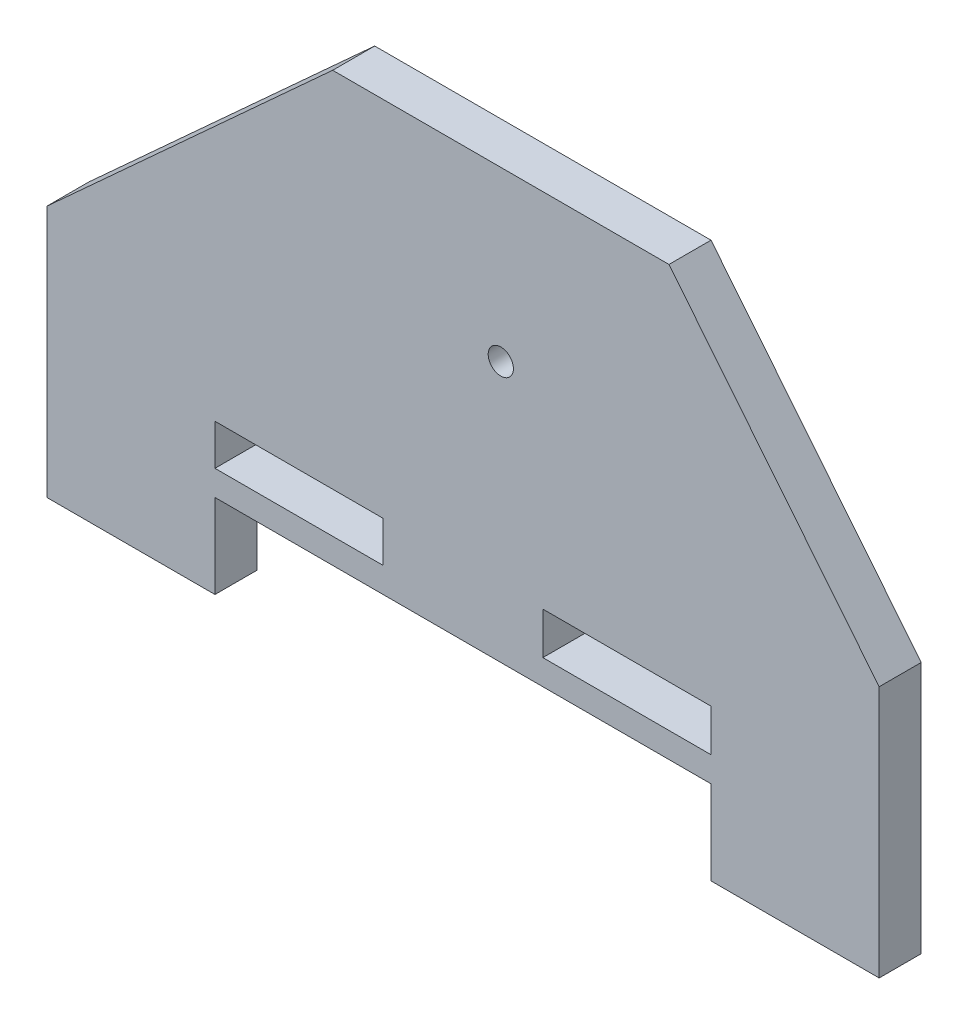
ISO-10303-21;
HEADER;
FILE_DESCRIPTION(('STEP AP214'),'2;1');
FILE_NAME('part.step','',(''),(''),'','','');
FILE_SCHEMA(('AUTOMOTIVE_DESIGN { 1 0 10303 214 1 1 1 1 }'));
ENDSEC;
DATA;
#1=APPLICATION_CONTEXT('core data for automotive mechanical design processes');
#2=APPLICATION_PROTOCOL_DEFINITION('international standard','automotive_design',2000,#1);
#3=PRODUCT_CONTEXT('',#1,'mechanical');
#4=PRODUCT('Part','Part','',(#3));
#5=PRODUCT_RELATED_PRODUCT_CATEGORY('part','',(#4));
#6=PRODUCT_DEFINITION_FORMATION('','',#4);
#7=PRODUCT_DEFINITION_CONTEXT('part definition',#1,'design');
#8=PRODUCT_DEFINITION('design','',#6,#7);
#9=PRODUCT_DEFINITION_SHAPE('','',#8);
#10=(LENGTH_UNIT() NAMED_UNIT(*) SI_UNIT(.MILLI.,.METRE.));
#11=(NAMED_UNIT(*) PLANE_ANGLE_UNIT() SI_UNIT($,.RADIAN.));
#12=(NAMED_UNIT(*) SI_UNIT($,.STERADIAN.) SOLID_ANGLE_UNIT());
#13=UNCERTAINTY_MEASURE_WITH_UNIT(LENGTH_MEASURE(1.E-05),#10,'distance_accuracy_value','');
#14=(GEOMETRIC_REPRESENTATION_CONTEXT(3) GLOBAL_UNCERTAINTY_ASSIGNED_CONTEXT((#13)) GLOBAL_UNIT_ASSIGNED_CONTEXT((#10,
#11,#12)) REPRESENTATION_CONTEXT('',''));
#15=CARTESIAN_POINT('',(0.,0.,0.));
#16=DIRECTION('',(0.,0.,1.));
#17=DIRECTION('',(1.,0.,0.));
#18=AXIS2_PLACEMENT_3D('',#15,#16,#17);
#19=CARTESIAN_POINT('',(0.,0.,5.));
#20=DIRECTION('',(0.,0.,1.));
#21=DIRECTION('',(1.,0.,0.));
#22=AXIS2_PLACEMENT_3D('',#19,#20,#21);
#23=PLANE('',#22);
#24=DIRECTION('',(0.,-1.,0.));
#25=VECTOR('',#24,1.);
#26=CARTESIAN_POINT('',(-36.4823986823426,-14.4861046142736,5.));
#27=LINE('',#26,#25);
#28=CARTESIAN_POINT('',(-36.4823986823426,15.5138953857264,5.));
#29=VERTEX_POINT('',#28);
#30=CARTESIAN_POINT('',(-36.4823986823426,-14.4861046142736,5.));
#31=VERTEX_POINT('',#30);
#32=EDGE_CURVE('E231',#29,#31,#27,.T.);
#33=ORIENTED_EDGE('',*,*,#32,.T.);
#34=DIRECTION('',(1.,0.,0.));
#35=VECTOR('',#34,1.);
#36=CARTESIAN_POINT('',(-36.4823986823426,-14.4861046142736,5.));
#37=LINE('',#36,#35);
#38=CARTESIAN_POINT('',(-16.4823986823426,-14.4861046142736,5.));
#39=VERTEX_POINT('',#38);
#40=EDGE_CURVE('E234',#31,#39,#37,.T.);
#41=ORIENTED_EDGE('',*,*,#40,.T.);
#42=DIRECTION('',(0.,1.,0.));
#43=VECTOR('',#42,1.);
#44=CARTESIAN_POINT('',(-16.4823986823426,-14.4861046142736,5.));
#45=LINE('',#44,#43);
#46=CARTESIAN_POINT('',(-16.4823986823426,-4.48610461427365,5.));
#47=VERTEX_POINT('',#46);
#48=EDGE_CURVE('E237',#39,#47,#45,.T.);
#49=ORIENTED_EDGE('',*,*,#48,.T.);
#50=DIRECTION('',(1.,0.,0.));
#51=VECTOR('',#50,1.);
#52=CARTESIAN_POINT('',(-16.4823986823426,-4.48610461427365,5.));
#53=LINE('',#52,#51);
#54=CARTESIAN_POINT('',(42.5176013176574,-4.48610461427365,5.));
#55=VERTEX_POINT('',#54);
#56=EDGE_CURVE('E239',#47,#55,#53,.T.);
#57=ORIENTED_EDGE('',*,*,#56,.T.);
#58=DIRECTION('',(0.,-1.,0.));
#59=VECTOR('',#58,1.);
#60=CARTESIAN_POINT('',(42.5176013176574,-4.48610461427365,5.));
#61=LINE('',#60,#59);
#62=CARTESIAN_POINT('',(42.5176013176574,-14.4861046142736,5.));
#63=VERTEX_POINT('',#62);
#64=EDGE_CURVE('E241',#55,#63,#61,.T.);
#65=ORIENTED_EDGE('',*,*,#64,.T.);
#66=DIRECTION('',(1.,0.,0.));
#67=VECTOR('',#66,1.);
#68=CARTESIAN_POINT('',(42.5176013176574,-14.4861046142736,5.));
#69=LINE('',#68,#67);
#70=CARTESIAN_POINT('',(62.5176013176575,-14.4861046142736,5.));
#71=VERTEX_POINT('',#70);
#72=EDGE_CURVE('E243',#63,#71,#69,.T.);
#73=ORIENTED_EDGE('',*,*,#72,.T.);
#74=DIRECTION('',(0.,1.,0.));
#75=VECTOR('',#74,1.);
#76=CARTESIAN_POINT('',(62.5176013176575,-14.4861046142736,5.));
#77=LINE('',#76,#75);
#78=CARTESIAN_POINT('',(62.5176013176575,15.5138953857263,5.));
#79=VERTEX_POINT('',#78);
#80=EDGE_CURVE('E245',#71,#79,#77,.T.);
#81=ORIENTED_EDGE('',*,*,#80,.T.);
#82=DIRECTION('',(-0.627752451189782,0.778413039475329,0.));
#83=VECTOR('',#82,1.);
#84=CARTESIAN_POINT('',(37.5176013176574,46.5138953857264,5.));
#85=LINE('',#84,#83);
#86=CARTESIAN_POINT('',(37.5176013176574,46.5138953857264,5.));
#87=VERTEX_POINT('',#86);
#88=EDGE_CURVE('E247',#79,#87,#85,.T.);
#89=ORIENTED_EDGE('',*,*,#88,.T.);
#90=DIRECTION('',(-1.,0.,0.));
#91=VECTOR('',#90,1.);
#92=CARTESIAN_POINT('',(17.5176013176574,46.5138953857264,5.));
#93=LINE('',#92,#91);
#94=CARTESIAN_POINT('',(-2.48239868234256,46.5138953857264,5.));
#95=VERTEX_POINT('',#94);
#96=EDGE_CURVE('E249',#87,#95,#93,.T.);
#97=ORIENTED_EDGE('',*,*,#96,.T.);
#98=DIRECTION('',(-0.738955843913329,-0.673753857685683,0.));
#99=VECTOR('',#98,1.);
#100=CARTESIAN_POINT('',(-36.4823986823426,15.5138953857264,5.));
#101=LINE('',#100,#99);
#102=EDGE_CURVE('E251',#95,#29,#101,.T.);
#103=ORIENTED_EDGE('',*,*,#102,.T.);
#104=EDGE_LOOP('',(#33,#41,#49,#57,#65,#73,#81,#89,#97,#103));
#105=FACE_BOUND('',#104,.T.);
#106=CARTESIAN_POINT('',(17.5176013176574,26.5138953857264,5.));
#107=DIRECTION('',(0.,0.,1.));
#108=DIRECTION('',(1.,0.,0.));
#109=AXIS2_PLACEMENT_3D('',#106,#107,#108);
#110=CIRCLE('',#109,1.5);
#111=CARTESIAN_POINT('',(19.0176013176574,26.5138953857264,5.));
#112=VERTEX_POINT('',#111);
#113=EDGE_CURVE('E225',#112,#112,#110,.T.);
#114=ORIENTED_EDGE('',*,*,#113,.F.);
#115=EDGE_LOOP('',(#114));
#116=FACE_BOUND('',#115,.T.);
#117=DIRECTION('',(1.,0.,0.));
#118=VECTOR('',#117,1.);
#119=CARTESIAN_POINT('',(-16.4823986823426,-1.48610461427365,5.));
#120=LINE('',#119,#118);
#121=CARTESIAN_POINT('',(-16.4823986823426,-1.48610461427365,5.));
#122=VERTEX_POINT('',#121);
#123=CARTESIAN_POINT('',(3.51760131765744,-1.48610461427365,5.));
#124=VERTEX_POINT('',#123);
#125=EDGE_CURVE('E196',#122,#124,#120,.T.);
#126=ORIENTED_EDGE('',*,*,#125,.F.);
#127=DIRECTION('',(0.,-1.,0.));
#128=VECTOR('',#127,1.);
#129=CARTESIAN_POINT('',(-16.4823986823426,-1.48610461427365,5.));
#130=LINE('',#129,#128);
#131=CARTESIAN_POINT('',(-16.4823986823426,3.36258666969225,5.));
#132=VERTEX_POINT('',#131);
#133=EDGE_CURVE('E194',#132,#122,#130,.T.);
#134=ORIENTED_EDGE('',*,*,#133,.F.);
#135=DIRECTION('',(-1.,0.,0.));
#136=VECTOR('',#135,1.);
#137=CARTESIAN_POINT('',(-16.4823986823426,3.36258666969225,5.));
#138=LINE('',#137,#136);
#139=CARTESIAN_POINT('',(3.51760131765744,3.36258666969225,5.));
#140=VERTEX_POINT('',#139);
#141=EDGE_CURVE('E202',#140,#132,#138,.T.);
#142=ORIENTED_EDGE('',*,*,#141,.F.);
#143=DIRECTION('',(0.,1.,0.));
#144=VECTOR('',#143,1.);
#145=CARTESIAN_POINT('',(3.51760131765744,-1.48610461427365,5.));
#146=LINE('',#145,#144);
#147=EDGE_CURVE('E199',#124,#140,#146,.T.);
#148=ORIENTED_EDGE('',*,*,#147,.F.);
#149=EDGE_LOOP('',(#126,#134,#142,#148));
#150=FACE_BOUND('',#149,.T.);
#151=DIRECTION('',(1.,0.,0.));
#152=VECTOR('',#151,1.);
#153=CARTESIAN_POINT('',(22.5176013176574,-1.48610461427365,5.));
#154=LINE('',#153,#152);
#155=CARTESIAN_POINT('',(22.5176013176574,-1.48610461427365,5.));
#156=VERTEX_POINT('',#155);
#157=CARTESIAN_POINT('',(42.5176013176574,-1.48610461427365,5.));
#158=VERTEX_POINT('',#157);
#159=EDGE_CURVE('E166',#156,#158,#154,.T.);
#160=ORIENTED_EDGE('',*,*,#159,.F.);
#161=DIRECTION('',(0.,-1.,0.));
#162=VECTOR('',#161,1.);
#163=CARTESIAN_POINT('',(22.5176013176574,-1.48610461427365,5.));
#164=LINE('',#163,#162);
#165=CARTESIAN_POINT('',(22.5176013176574,3.51389538572635,5.));
#166=VERTEX_POINT('',#165);
#167=EDGE_CURVE('E158',#166,#156,#164,.T.);
#168=ORIENTED_EDGE('',*,*,#167,.F.);
#169=DIRECTION('',(-1.,0.,0.));
#170=VECTOR('',#169,1.);
#171=CARTESIAN_POINT('',(22.5176013176574,3.51389538572635,5.));
#172=LINE('',#171,#170);
#173=CARTESIAN_POINT('',(42.5176013176574,3.51389538572635,5.));
#174=VERTEX_POINT('',#173);
#175=EDGE_CURVE('E180',#174,#166,#172,.T.);
#176=ORIENTED_EDGE('',*,*,#175,.F.);
#177=DIRECTION('',(0.,1.,0.));
#178=VECTOR('',#177,1.);
#179=CARTESIAN_POINT('',(42.5176013176574,-1.48610461427365,5.));
#180=LINE('',#179,#178);
#181=EDGE_CURVE('E178',#158,#174,#180,.T.);
#182=ORIENTED_EDGE('',*,*,#181,.F.);
#183=EDGE_LOOP('',(#160,#168,#176,#182));
#184=FACE_BOUND('',#183,.T.);
#185=ADVANCED_FACE('F33',(#105,#116,#150,#184),#23,.T.);
#186=CARTESIAN_POINT('',(0.,0.,0.));
#187=DIRECTION('',(0.,0.,1.));
#188=DIRECTION('',(1.,0.,0.));
#189=AXIS2_PLACEMENT_3D('',#186,#187,#188);
#190=PLANE('',#189);
#191=DIRECTION('',(0.,-1.,0.));
#192=VECTOR('',#191,1.);
#193=CARTESIAN_POINT('',(-16.4823986823426,-1.48610461427365,0.));
#194=LINE('',#193,#192);
#195=CARTESIAN_POINT('',(-16.4823986823426,3.36258666969225,0.));
#196=VERTEX_POINT('',#195);
#197=CARTESIAN_POINT('',(-16.4823986823426,-1.48610461427365,0.));
#198=VERTEX_POINT('',#197);
#199=EDGE_CURVE('E174',#196,#198,#194,.T.);
#200=ORIENTED_EDGE('',*,*,#199,.T.);
#201=DIRECTION('',(1.,0.,0.));
#202=VECTOR('',#201,1.);
#203=CARTESIAN_POINT('',(-16.4823986823426,-1.48610461427365,0.));
#204=LINE('',#203,#202);
#205=CARTESIAN_POINT('',(3.51760131765744,-1.48610461427365,0.));
#206=VERTEX_POINT('',#205);
#207=EDGE_CURVE('E207',#198,#206,#204,.T.);
#208=ORIENTED_EDGE('',*,*,#207,.T.);
#209=DIRECTION('',(0.,1.,0.));
#210=VECTOR('',#209,1.);
#211=CARTESIAN_POINT('',(3.51760131765744,-1.48610461427365,0.));
#212=LINE('',#211,#210);
#213=CARTESIAN_POINT('',(3.51760131765744,3.36258666969225,0.));
#214=VERTEX_POINT('',#213);
#215=EDGE_CURVE('E210',#206,#214,#212,.T.);
#216=ORIENTED_EDGE('',*,*,#215,.T.);
#217=DIRECTION('',(-1.,0.,0.));
#218=VECTOR('',#217,1.);
#219=CARTESIAN_POINT('',(-16.4823986823426,3.36258666969225,0.));
#220=LINE('',#219,#218);
#221=EDGE_CURVE('E197',#214,#196,#220,.T.);
#222=ORIENTED_EDGE('',*,*,#221,.T.);
#223=EDGE_LOOP('',(#200,#208,#216,#222));
#224=FACE_BOUND('',#223,.T.);
#225=DIRECTION('',(0.,-1.,0.));
#226=VECTOR('',#225,1.);
#227=CARTESIAN_POINT('',(-36.4823986823426,-14.4861046142736,0.));
#228=LINE('',#227,#226);
#229=CARTESIAN_POINT('',(-36.4823986823426,15.5138953857264,0.));
#230=VERTEX_POINT('',#229);
#231=CARTESIAN_POINT('',(-36.4823986823426,-14.4861046142736,0.));
#232=VERTEX_POINT('',#231);
#233=EDGE_CURVE('E228',#230,#232,#228,.T.);
#234=ORIENTED_EDGE('',*,*,#233,.F.);
#235=DIRECTION('',(-0.738955843913329,-0.673753857685683,0.));
#236=VECTOR('',#235,1.);
#237=CARTESIAN_POINT('',(-36.4823986823426,15.5138953857264,0.));
#238=LINE('',#237,#236);
#239=CARTESIAN_POINT('',(-2.48239868234256,46.5138953857264,0.));
#240=VERTEX_POINT('',#239);
#241=EDGE_CURVE('E235',#240,#230,#238,.T.);
#242=ORIENTED_EDGE('',*,*,#241,.F.);
#243=DIRECTION('',(-1.,0.,0.));
#244=VECTOR('',#243,1.);
#245=CARTESIAN_POINT('',(17.5176013176574,46.5138953857264,0.));
#246=LINE('',#245,#244);
#247=CARTESIAN_POINT('',(37.5176013176574,46.5138953857264,0.));
#248=VERTEX_POINT('',#247);
#249=EDGE_CURVE('E271',#248,#240,#246,.T.);
#250=ORIENTED_EDGE('',*,*,#249,.F.);
#251=DIRECTION('',(-0.627752451189782,0.778413039475329,0.));
#252=VECTOR('',#251,1.);
#253=CARTESIAN_POINT('',(37.5176013176574,46.5138953857264,0.));
#254=LINE('',#253,#252);
#255=CARTESIAN_POINT('',(62.5176013176575,15.5138953857263,0.));
#256=VERTEX_POINT('',#255);
#257=EDGE_CURVE('E268',#256,#248,#254,.T.);
#258=ORIENTED_EDGE('',*,*,#257,.F.);
#259=DIRECTION('',(0.,1.,0.));
#260=VECTOR('',#259,1.);
#261=CARTESIAN_POINT('',(62.5176013176575,-14.4861046142736,0.));
#262=LINE('',#261,#260);
#263=CARTESIAN_POINT('',(62.5176013176575,-14.4861046142736,0.));
#264=VERTEX_POINT('',#263);
#265=EDGE_CURVE('E266',#264,#256,#262,.T.);
#266=ORIENTED_EDGE('',*,*,#265,.F.);
#267=DIRECTION('',(1.,0.,0.));
#268=VECTOR('',#267,1.);
#269=CARTESIAN_POINT('',(42.5176013176574,-14.4861046142736,0.));
#270=LINE('',#269,#268);
#271=CARTESIAN_POINT('',(42.5176013176574,-14.4861046142736,0.));
#272=VERTEX_POINT('',#271);
#273=EDGE_CURVE('E264',#272,#264,#270,.T.);
#274=ORIENTED_EDGE('',*,*,#273,.F.);
#275=DIRECTION('',(0.,-1.,0.));
#276=VECTOR('',#275,1.);
#277=CARTESIAN_POINT('',(42.5176013176574,-4.48610461427365,0.));
#278=LINE('',#277,#276);
#279=CARTESIAN_POINT('',(42.5176013176574,-4.48610461427365,0.));
#280=VERTEX_POINT('',#279);
#281=EDGE_CURVE('E262',#280,#272,#278,.T.);
#282=ORIENTED_EDGE('',*,*,#281,.F.);
#283=DIRECTION('',(1.,0.,0.));
#284=VECTOR('',#283,1.);
#285=CARTESIAN_POINT('',(-16.4823986823426,-4.48610461427365,0.));
#286=LINE('',#285,#284);
#287=CARTESIAN_POINT('',(-16.4823986823426,-4.48610461427365,0.));
#288=VERTEX_POINT('',#287);
#289=EDGE_CURVE('E260',#288,#280,#286,.T.);
#290=ORIENTED_EDGE('',*,*,#289,.F.);
#291=DIRECTION('',(0.,1.,0.));
#292=VECTOR('',#291,1.);
#293=CARTESIAN_POINT('',(-16.4823986823426,-14.4861046142736,0.));
#294=LINE('',#293,#292);
#295=CARTESIAN_POINT('',(-16.4823986823426,-14.4861046142736,0.));
#296=VERTEX_POINT('',#295);
#297=EDGE_CURVE('E258',#296,#288,#294,.T.);
#298=ORIENTED_EDGE('',*,*,#297,.F.);
#299=DIRECTION('',(1.,0.,0.));
#300=VECTOR('',#299,1.);
#301=CARTESIAN_POINT('',(-36.4823986823426,-14.4861046142736,0.));
#302=LINE('',#301,#300);
#303=EDGE_CURVE('E256',#232,#296,#302,.T.);
#304=ORIENTED_EDGE('',*,*,#303,.F.);
#305=EDGE_LOOP('',(#234,#242,#250,#258,#266,#274,#282,#290,#298,#304));
#306=FACE_BOUND('',#305,.T.);
#307=CARTESIAN_POINT('',(17.5176013176574,26.5138953857264,0.));
#308=DIRECTION('',(0.,0.,1.));
#309=DIRECTION('',(1.,0.,0.));
#310=AXIS2_PLACEMENT_3D('',#307,#308,#309);
#311=CIRCLE('',#310,1.5);
#312=CARTESIAN_POINT('',(19.0176013176574,26.5138953857264,0.));
#313=VERTEX_POINT('',#312);
#314=EDGE_CURVE('E224',#313,#313,#311,.T.);
#315=ORIENTED_EDGE('',*,*,#314,.T.);
#316=EDGE_LOOP('',(#315));
#317=FACE_BOUND('',#316,.T.);
#318=DIRECTION('',(0.,-1.,0.));
#319=VECTOR('',#318,1.);
#320=CARTESIAN_POINT('',(22.5176013176574,-1.48610461427365,0.));
#321=LINE('',#320,#319);
#322=CARTESIAN_POINT('',(22.5176013176574,3.51389538572635,0.));
#323=VERTEX_POINT('',#322);
#324=CARTESIAN_POINT('',(22.5176013176574,-1.48610461427365,0.));
#325=VERTEX_POINT('',#324);
#326=EDGE_CURVE('E56',#323,#325,#321,.T.);
#327=ORIENTED_EDGE('',*,*,#326,.T.);
#328=DIRECTION('',(1.,0.,0.));
#329=VECTOR('',#328,1.);
#330=CARTESIAN_POINT('',(22.5176013176574,-1.48610461427365,0.));
#331=LINE('',#330,#329);
#332=CARTESIAN_POINT('',(42.5176013176574,-1.48610461427365,0.));
#333=VERTEX_POINT('',#332);
#334=EDGE_CURVE('E173',#325,#333,#331,.T.);
#335=ORIENTED_EDGE('',*,*,#334,.T.);
#336=DIRECTION('',(0.,1.,0.));
#337=VECTOR('',#336,1.);
#338=CARTESIAN_POINT('',(42.5176013176574,-1.48610461427365,0.));
#339=LINE('',#338,#337);
#340=CARTESIAN_POINT('',(42.5176013176574,3.51389538572635,0.));
#341=VERTEX_POINT('',#340);
#342=EDGE_CURVE('E186',#333,#341,#339,.T.);
#343=ORIENTED_EDGE('',*,*,#342,.T.);
#344=DIRECTION('',(-1.,0.,0.));
#345=VECTOR('',#344,1.);
#346=CARTESIAN_POINT('',(22.5176013176574,3.51389538572635,0.));
#347=LINE('',#346,#345);
#348=EDGE_CURVE('E167',#341,#323,#347,.T.);
#349=ORIENTED_EDGE('',*,*,#348,.T.);
#350=EDGE_LOOP('',(#327,#335,#343,#349));
#351=FACE_BOUND('',#350,.T.);
#352=ADVANCED_FACE('F307',(#224,#306,#317,#351),#190,.F.);
#353=CARTESIAN_POINT('',(-36.4823986823426,-14.4861046142736,5.));
#354=DIRECTION('',(1.,0.,0.));
#355=DIRECTION('',(0.,0.,-1.));
#356=AXIS2_PLACEMENT_3D('',#353,#354,#355);
#357=PLANE('',#356);
#358=ORIENTED_EDGE('',*,*,#233,.T.);
#359=DIRECTION('',(0.,0.,-1.));
#360=VECTOR('',#359,1.);
#361=CARTESIAN_POINT('',(-36.4823986823426,-14.4861046142736,5.));
#362=LINE('',#361,#360);
#363=EDGE_CURVE('E11',#31,#232,#362,.T.);
#364=ORIENTED_EDGE('',*,*,#363,.F.);
#365=ORIENTED_EDGE('',*,*,#32,.F.);
#366=DIRECTION('',(0.,0.,-1.));
#367=VECTOR('',#366,1.);
#368=CARTESIAN_POINT('',(-36.4823986823426,15.5138953857264,5.));
#369=LINE('',#368,#367);
#370=EDGE_CURVE('E253',#29,#230,#369,.T.);
#371=ORIENTED_EDGE('',*,*,#370,.T.);
#372=EDGE_LOOP('',(#358,#364,#365,#371));
#373=FACE_BOUND('',#372,.T.);
#374=ADVANCED_FACE('F35',(#373),#357,.F.);
#375=CARTESIAN_POINT('',(-36.4823986823426,-14.4861046142736,5.));
#376=DIRECTION('',(0.,1.,0.));
#377=DIRECTION('',(0.,0.,1.));
#378=AXIS2_PLACEMENT_3D('',#375,#376,#377);
#379=PLANE('',#378);
#380=ORIENTED_EDGE('',*,*,#303,.T.);
#381=DIRECTION('',(0.,0.,-1.));
#382=VECTOR('',#381,1.);
#383=CARTESIAN_POINT('',(-16.4823986823426,-14.4861046142736,5.));
#384=LINE('',#383,#382);
#385=EDGE_CURVE('E41',#39,#296,#384,.T.);
#386=ORIENTED_EDGE('',*,*,#385,.F.);
#387=ORIENTED_EDGE('',*,*,#40,.F.);
#388=ORIENTED_EDGE('',*,*,#363,.T.);
#389=EDGE_LOOP('',(#380,#386,#387,#388));
#390=FACE_BOUND('',#389,.T.);
#391=ADVANCED_FACE('F325',(#390),#379,.F.);
#392=CARTESIAN_POINT('',(-16.4823986823426,-14.4861046142736,5.));
#393=DIRECTION('',(-1.,0.,0.));
#394=DIRECTION('',(0.,0.,1.));
#395=AXIS2_PLACEMENT_3D('',#392,#393,#394);
#396=PLANE('',#395);
#397=ORIENTED_EDGE('',*,*,#297,.T.);
#398=DIRECTION('',(0.,0.,-1.));
#399=VECTOR('',#398,1.);
#400=CARTESIAN_POINT('',(-16.4823986823426,-4.48610461427365,5.));
#401=LINE('',#400,#399);
#402=EDGE_CURVE('E294',#47,#288,#401,.T.);
#403=ORIENTED_EDGE('',*,*,#402,.F.);
#404=ORIENTED_EDGE('',*,*,#48,.F.);
#405=ORIENTED_EDGE('',*,*,#385,.T.);
#406=EDGE_LOOP('',(#397,#403,#404,#405));
#407=FACE_BOUND('',#406,.T.);
#408=ADVANCED_FACE('F301',(#407),#396,.F.);
#409=CARTESIAN_POINT('',(-16.4823986823426,-4.48610461427365,5.));
#410=DIRECTION('',(0.,1.,0.));
#411=DIRECTION('',(0.,0.,1.));
#412=AXIS2_PLACEMENT_3D('',#409,#410,#411);
#413=PLANE('',#412);
#414=ORIENTED_EDGE('',*,*,#289,.T.);
#415=DIRECTION('',(0.,0.,-1.));
#416=VECTOR('',#415,1.);
#417=CARTESIAN_POINT('',(42.5176013176574,-4.48610461427365,5.));
#418=LINE('',#417,#416);
#419=EDGE_CURVE('E291',#55,#280,#418,.T.);
#420=ORIENTED_EDGE('',*,*,#419,.F.);
#421=ORIENTED_EDGE('',*,*,#56,.F.);
#422=ORIENTED_EDGE('',*,*,#402,.T.);
#423=EDGE_LOOP('',(#414,#420,#421,#422));
#424=FACE_BOUND('',#423,.T.);
#425=ADVANCED_FACE('F313',(#424),#413,.F.);
#426=CARTESIAN_POINT('',(42.5176013176574,-4.48610461427365,5.));
#427=DIRECTION('',(1.,0.,0.));
#428=DIRECTION('',(0.,0.,-1.));
#429=AXIS2_PLACEMENT_3D('',#426,#427,#428);
#430=PLANE('',#429);
#431=ORIENTED_EDGE('',*,*,#281,.T.);
#432=DIRECTION('',(0.,0.,-1.));
#433=VECTOR('',#432,1.);
#434=CARTESIAN_POINT('',(42.5176013176574,-14.4861046142736,5.));
#435=LINE('',#434,#433);
#436=EDGE_CURVE('E288',#63,#272,#435,.T.);
#437=ORIENTED_EDGE('',*,*,#436,.F.);
#438=ORIENTED_EDGE('',*,*,#64,.F.);
#439=ORIENTED_EDGE('',*,*,#419,.T.);
#440=EDGE_LOOP('',(#431,#437,#438,#439));
#441=FACE_BOUND('',#440,.T.);
#442=ADVANCED_FACE('F317',(#441),#430,.F.);
#443=CARTESIAN_POINT('',(42.5176013176574,-14.4861046142736,5.));
#444=DIRECTION('',(0.,1.,0.));
#445=DIRECTION('',(-1.,0.,0.));
#446=AXIS2_PLACEMENT_3D('',#443,#444,#445);
#447=PLANE('',#446);
#448=ORIENTED_EDGE('',*,*,#273,.T.);
#449=DIRECTION('',(0.,0.,-1.));
#450=VECTOR('',#449,1.);
#451=CARTESIAN_POINT('',(62.5176013176575,-14.4861046142736,5.));
#452=LINE('',#451,#450);
#453=EDGE_CURVE('E285',#71,#264,#452,.T.);
#454=ORIENTED_EDGE('',*,*,#453,.F.);
#455=ORIENTED_EDGE('',*,*,#72,.F.);
#456=ORIENTED_EDGE('',*,*,#436,.T.);
#457=EDGE_LOOP('',(#448,#454,#455,#456));
#458=FACE_BOUND('',#457,.T.);
#459=ADVANCED_FACE('F347',(#458),#447,.F.);
#460=CARTESIAN_POINT('',(62.5176013176575,-14.4861046142736,5.));
#461=DIRECTION('',(-1.,0.,0.));
#462=DIRECTION('',(0.,0.,1.));
#463=AXIS2_PLACEMENT_3D('',#460,#461,#462);
#464=PLANE('',#463);
#465=ORIENTED_EDGE('',*,*,#265,.T.);
#466=DIRECTION('',(0.,0.,-1.));
#467=VECTOR('',#466,1.);
#468=CARTESIAN_POINT('',(62.5176013176575,15.5138953857263,5.));
#469=LINE('',#468,#467);
#470=EDGE_CURVE('E282',#79,#256,#469,.T.);
#471=ORIENTED_EDGE('',*,*,#470,.F.);
#472=ORIENTED_EDGE('',*,*,#80,.F.);
#473=ORIENTED_EDGE('',*,*,#453,.T.);
#474=EDGE_LOOP('',(#465,#471,#472,#473));
#475=FACE_BOUND('',#474,.T.);
#476=ADVANCED_FACE('F344',(#475),#464,.F.);
#477=CARTESIAN_POINT('',(37.5176013176574,46.5138953857264,5.));
#478=DIRECTION('',(-0.778413039475329,-0.627752451189782,0.));
#479=DIRECTION('',(0.627752451189782,-0.778413039475329,0.));
#480=AXIS2_PLACEMENT_3D('',#477,#478,#479);
#481=PLANE('',#480);
#482=ORIENTED_EDGE('',*,*,#257,.T.);
#483=DIRECTION('',(0.,0.,-1.));
#484=VECTOR('',#483,1.);
#485=CARTESIAN_POINT('',(37.5176013176574,46.5138953857264,5.));
#486=LINE('',#485,#484);
#487=EDGE_CURVE('E279',#87,#248,#486,.T.);
#488=ORIENTED_EDGE('',*,*,#487,.F.);
#489=ORIENTED_EDGE('',*,*,#88,.F.);
#490=ORIENTED_EDGE('',*,*,#470,.T.);
#491=EDGE_LOOP('',(#482,#488,#489,#490));
#492=FACE_BOUND('',#491,.T.);
#493=ADVANCED_FACE('F340',(#492),#481,.F.);
#494=CARTESIAN_POINT('',(17.5176013176574,46.5138953857264,5.));
#495=DIRECTION('',(0.,-1.,0.));
#496=DIRECTION('',(0.,0.,-1.));
#497=AXIS2_PLACEMENT_3D('',#494,#495,#496);
#498=PLANE('',#497);
#499=ORIENTED_EDGE('',*,*,#249,.T.);
#500=DIRECTION('',(0.,0.,-1.));
#501=VECTOR('',#500,1.);
#502=CARTESIAN_POINT('',(-2.48239868234256,46.5138953857264,5.));
#503=LINE('',#502,#501);
#504=EDGE_CURVE('E276',#95,#240,#503,.T.);
#505=ORIENTED_EDGE('',*,*,#504,.F.);
#506=ORIENTED_EDGE('',*,*,#96,.F.);
#507=ORIENTED_EDGE('',*,*,#487,.T.);
#508=EDGE_LOOP('',(#499,#505,#506,#507));
#509=FACE_BOUND('',#508,.T.);
#510=ADVANCED_FACE('F336',(#509),#498,.F.);
#511=CARTESIAN_POINT('',(-36.4823986823426,15.5138953857264,5.));
#512=DIRECTION('',(0.673753857685683,-0.738955843913329,0.));
#513=DIRECTION('',(0.738955843913329,0.673753857685683,0.));
#514=AXIS2_PLACEMENT_3D('',#511,#512,#513);
#515=PLANE('',#514);
#516=ORIENTED_EDGE('',*,*,#241,.T.);
#517=ORIENTED_EDGE('',*,*,#370,.F.);
#518=ORIENTED_EDGE('',*,*,#102,.F.);
#519=ORIENTED_EDGE('',*,*,#504,.T.);
#520=EDGE_LOOP('',(#516,#517,#518,#519));
#521=FACE_BOUND('',#520,.T.);
#522=ADVANCED_FACE('F331',(#521),#515,.F.);
#523=CARTESIAN_POINT('',(17.5176013176574,26.5138953857264,5.));
#524=DIRECTION('',(0.,0.,-1.));
#525=DIRECTION('',(-1.,0.,0.));
#526=AXIS2_PLACEMENT_3D('',#523,#524,#525);
#527=CYLINDRICAL_SURFACE('',#526,1.5);
#528=ORIENTED_EDGE('',*,*,#113,.T.);
#529=EDGE_LOOP('',(#528));
#530=FACE_BOUND('',#529,.T.);
#531=ORIENTED_EDGE('',*,*,#314,.F.);
#532=EDGE_LOOP('',(#531));
#533=FACE_BOUND('',#532,.T.);
#534=ADVANCED_FACE('F364',(#530,#533),#527,.F.);
#535=CARTESIAN_POINT('',(-16.4823986823426,-1.48610461427365,5.));
#536=DIRECTION('',(1.,0.,0.));
#537=DIRECTION('',(0.,0.,-1.));
#538=AXIS2_PLACEMENT_3D('',#535,#536,#537);
#539=PLANE('',#538);
#540=ORIENTED_EDGE('',*,*,#199,.F.);
#541=DIRECTION('',(0.,0.,-1.));
#542=VECTOR('',#541,1.);
#543=CARTESIAN_POINT('',(-16.4823986823426,3.36258666969225,5.));
#544=LINE('',#543,#542);
#545=EDGE_CURVE('E204',#132,#196,#544,.T.);
#546=ORIENTED_EDGE('',*,*,#545,.F.);
#547=ORIENTED_EDGE('',*,*,#133,.T.);
#548=DIRECTION('',(0.,0.,-1.));
#549=VECTOR('',#548,1.);
#550=CARTESIAN_POINT('',(-16.4823986823426,-1.48610461427365,5.));
#551=LINE('',#550,#549);
#552=EDGE_CURVE('E221',#122,#198,#551,.T.);
#553=ORIENTED_EDGE('',*,*,#552,.T.);
#554=EDGE_LOOP('',(#540,#546,#547,#553));
#555=FACE_BOUND('',#554,.T.);
#556=ADVANCED_FACE('F390',(#555),#539,.T.);
#557=CARTESIAN_POINT('',(-16.4823986823426,-1.48610461427365,5.));
#558=DIRECTION('',(0.,1.,0.));
#559=DIRECTION('',(0.,0.,1.));
#560=AXIS2_PLACEMENT_3D('',#557,#558,#559);
#561=PLANE('',#560);
#562=ORIENTED_EDGE('',*,*,#207,.F.);
#563=ORIENTED_EDGE('',*,*,#552,.F.);
#564=ORIENTED_EDGE('',*,*,#125,.T.);
#565=DIRECTION('',(0.,0.,-1.));
#566=VECTOR('',#565,1.);
#567=CARTESIAN_POINT('',(3.51760131765744,-1.48610461427365,5.));
#568=LINE('',#567,#566);
#569=EDGE_CURVE('E219',#124,#206,#568,.T.);
#570=ORIENTED_EDGE('',*,*,#569,.T.);
#571=EDGE_LOOP('',(#562,#563,#564,#570));
#572=FACE_BOUND('',#571,.T.);
#573=ADVANCED_FACE('F397',(#572),#561,.T.);
#574=CARTESIAN_POINT('',(3.51760131765744,-1.48610461427365,5.));
#575=DIRECTION('',(-1.,0.,0.));
#576=DIRECTION('',(0.,0.,1.));
#577=AXIS2_PLACEMENT_3D('',#574,#575,#576);
#578=PLANE('',#577);
#579=ORIENTED_EDGE('',*,*,#215,.F.);
#580=ORIENTED_EDGE('',*,*,#569,.F.);
#581=ORIENTED_EDGE('',*,*,#147,.T.);
#582=DIRECTION('',(0.,0.,-1.));
#583=VECTOR('',#582,1.);
#584=CARTESIAN_POINT('',(3.51760131765744,3.36258666969225,5.));
#585=LINE('',#584,#583);
#586=EDGE_CURVE('E217',#140,#214,#585,.T.);
#587=ORIENTED_EDGE('',*,*,#586,.T.);
#588=EDGE_LOOP('',(#579,#580,#581,#587));
#589=FACE_BOUND('',#588,.T.);
#590=ADVANCED_FACE('F404',(#589),#578,.T.);
#591=CARTESIAN_POINT('',(-16.4823986823426,3.36258666969225,5.));
#592=DIRECTION('',(0.,-1.,0.));
#593=DIRECTION('',(0.,0.,-1.));
#594=AXIS2_PLACEMENT_3D('',#591,#592,#593);
#595=PLANE('',#594);
#596=ORIENTED_EDGE('',*,*,#221,.F.);
#597=ORIENTED_EDGE('',*,*,#586,.F.);
#598=ORIENTED_EDGE('',*,*,#141,.T.);
#599=ORIENTED_EDGE('',*,*,#545,.T.);
#600=EDGE_LOOP('',(#596,#597,#598,#599));
#601=FACE_BOUND('',#600,.T.);
#602=ADVANCED_FACE('F412',(#601),#595,.T.);
#603=CARTESIAN_POINT('',(22.5176013176574,-1.48610461427365,5.));
#604=DIRECTION('',(1.,0.,0.));
#605=DIRECTION('',(0.,0.,-1.));
#606=AXIS2_PLACEMENT_3D('',#603,#604,#605);
#607=PLANE('',#606);
#608=ORIENTED_EDGE('',*,*,#326,.F.);
#609=DIRECTION('',(0.,0.,-1.));
#610=VECTOR('',#609,1.);
#611=CARTESIAN_POINT('',(22.5176013176574,3.51389538572635,5.));
#612=LINE('',#611,#610);
#613=EDGE_CURVE('E162',#166,#323,#612,.T.);
#614=ORIENTED_EDGE('',*,*,#613,.F.);
#615=ORIENTED_EDGE('',*,*,#167,.T.);
#616=DIRECTION('',(0.,0.,-1.));
#617=VECTOR('',#616,1.);
#618=CARTESIAN_POINT('',(22.5176013176574,-1.48610461427365,5.));
#619=LINE('',#618,#617);
#620=EDGE_CURVE('E161',#156,#325,#619,.T.);
#621=ORIENTED_EDGE('',*,*,#620,.T.);
#622=EDGE_LOOP('',(#608,#614,#615,#621));
#623=FACE_BOUND('',#622,.T.);
#624=ADVANCED_FACE('F160',(#623),#607,.T.);
#625=CARTESIAN_POINT('',(22.5176013176574,-1.48610461427365,5.));
#626=DIRECTION('',(0.,1.,0.));
#627=DIRECTION('',(0.,0.,1.));
#628=AXIS2_PLACEMENT_3D('',#625,#626,#627);
#629=PLANE('',#628);
#630=ORIENTED_EDGE('',*,*,#334,.F.);
#631=ORIENTED_EDGE('',*,*,#620,.F.);
#632=ORIENTED_EDGE('',*,*,#159,.T.);
#633=DIRECTION('',(0.,0.,-1.));
#634=VECTOR('',#633,1.);
#635=CARTESIAN_POINT('',(42.5176013176574,-1.48610461427365,5.));
#636=LINE('',#635,#634);
#637=EDGE_CURVE('E175',#158,#333,#636,.T.);
#638=ORIENTED_EDGE('',*,*,#637,.T.);
#639=EDGE_LOOP('',(#630,#631,#632,#638));
#640=FACE_BOUND('',#639,.T.);
#641=ADVANCED_FACE('F170',(#640),#629,.T.);
#642=CARTESIAN_POINT('',(42.5176013176574,-1.48610461427365,5.));
#643=DIRECTION('',(-1.,0.,0.));
#644=DIRECTION('',(0.,0.,1.));
#645=AXIS2_PLACEMENT_3D('',#642,#643,#644);
#646=PLANE('',#645);
#647=ORIENTED_EDGE('',*,*,#342,.F.);
#648=ORIENTED_EDGE('',*,*,#637,.F.);
#649=ORIENTED_EDGE('',*,*,#181,.T.);
#650=DIRECTION('',(0.,0.,-1.));
#651=VECTOR('',#650,1.);
#652=CARTESIAN_POINT('',(42.5176013176574,3.51389538572635,5.));
#653=LINE('',#652,#651);
#654=EDGE_CURVE('E48',#174,#341,#653,.T.);
#655=ORIENTED_EDGE('',*,*,#654,.T.);
#656=EDGE_LOOP('',(#647,#648,#649,#655));
#657=FACE_BOUND('',#656,.T.);
#658=ADVANCED_FACE('F433',(#657),#646,.T.);
#659=CARTESIAN_POINT('',(22.5176013176574,3.51389538572635,5.));
#660=DIRECTION('',(0.,-1.,0.));
#661=DIRECTION('',(1.,0.,0.));
#662=AXIS2_PLACEMENT_3D('',#659,#660,#661);
#663=PLANE('',#662);
#664=ORIENTED_EDGE('',*,*,#348,.F.);
#665=ORIENTED_EDGE('',*,*,#654,.F.);
#666=ORIENTED_EDGE('',*,*,#175,.T.);
#667=ORIENTED_EDGE('',*,*,#613,.T.);
#668=EDGE_LOOP('',(#664,#665,#666,#667));
#669=FACE_BOUND('',#668,.T.);
#670=ADVANCED_FACE('F440',(#669),#663,.T.);
#671=CLOSED_SHELL('',(#185,#352,#374,#391,#408,#425,#442,#459,#476,#493,#510,#522,#534,#556,
#573,#590,#602,#624,#641,#658,#670));
#672=MANIFOLD_SOLID_BREP('B2',#671);
#673=ADVANCED_BREP_SHAPE_REPRESENTATION('',(#18,#672),#14);
#674=SHAPE_DEFINITION_REPRESENTATION(#9,#673);
ENDSEC;
END-ISO-10303-21;
